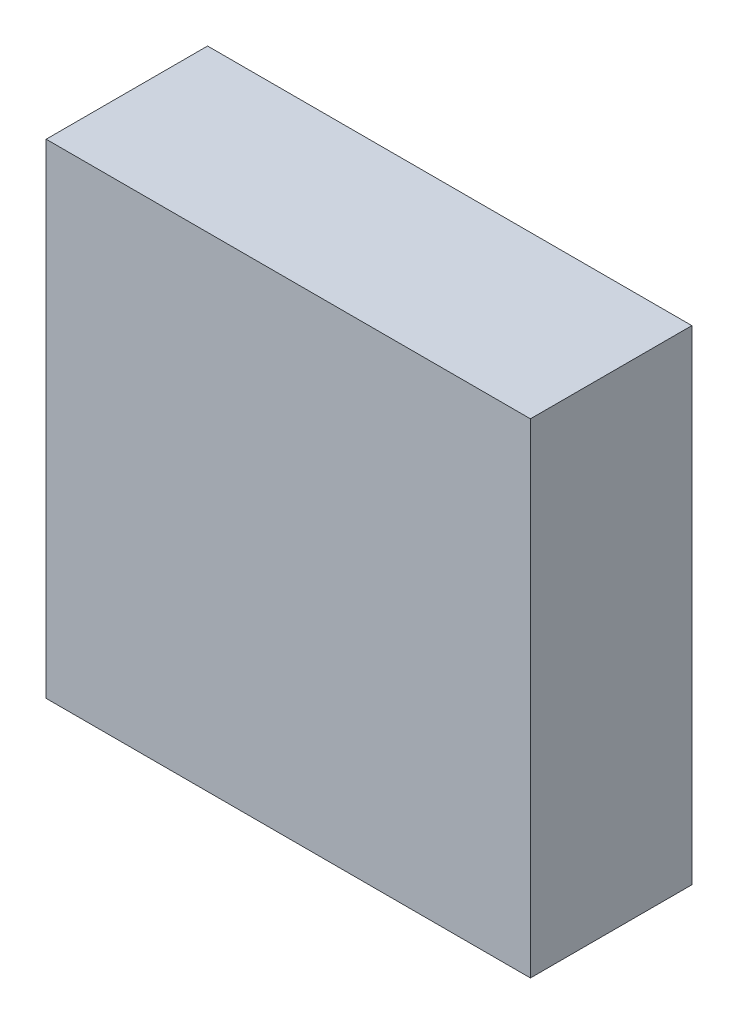
ISO-10303-21;
HEADER;
FILE_DESCRIPTION(('STEP AP214'),'2;1');
FILE_NAME('part.step','',(''),(''),'','','');
FILE_SCHEMA(('AUTOMOTIVE_DESIGN { 1 0 10303 214 1 1 1 1 }'));
ENDSEC;
DATA;
#1=APPLICATION_CONTEXT('core data for automotive mechanical design processes');
#2=APPLICATION_PROTOCOL_DEFINITION('international standard','automotive_design',2000,#1);
#3=PRODUCT_CONTEXT('',#1,'mechanical');
#4=PRODUCT('Part','Part','',(#3));
#5=PRODUCT_RELATED_PRODUCT_CATEGORY('part','',(#4));
#6=PRODUCT_DEFINITION_FORMATION('','',#4);
#7=PRODUCT_DEFINITION_CONTEXT('part definition',#1,'design');
#8=PRODUCT_DEFINITION('design','',#6,#7);
#9=PRODUCT_DEFINITION_SHAPE('','',#8);
#10=(LENGTH_UNIT() NAMED_UNIT(*) SI_UNIT(.MILLI.,.METRE.));
#11=(NAMED_UNIT(*) PLANE_ANGLE_UNIT() SI_UNIT($,.RADIAN.));
#12=(NAMED_UNIT(*) SI_UNIT($,.STERADIAN.) SOLID_ANGLE_UNIT());
#13=UNCERTAINTY_MEASURE_WITH_UNIT(LENGTH_MEASURE(1.E-05),#10,'distance_accuracy_value','');
#14=(GEOMETRIC_REPRESENTATION_CONTEXT(3) GLOBAL_UNCERTAINTY_ASSIGNED_CONTEXT((#13)) GLOBAL_UNIT_ASSIGNED_CONTEXT((#10,
#11,#12)) REPRESENTATION_CONTEXT('',''));
#15=CARTESIAN_POINT('',(0.,0.,0.));
#16=DIRECTION('',(0.,0.,1.));
#17=DIRECTION('',(1.,0.,0.));
#18=AXIS2_PLACEMENT_3D('',#15,#16,#17);
#19=CARTESIAN_POINT('',(1.49998176,-1.49998176,0.));
#20=DIRECTION('',(0.,0.,-1.));
#21=DIRECTION('',(-1.,0.,0.));
#22=AXIS2_PLACEMENT_3D('',#19,#20,#21);
#23=PLANE('',#22);
#24=DIRECTION('',(1.,0.,0.));
#25=VECTOR('',#24,1.);
#26=CARTESIAN_POINT('',(1.49998176,1.49998176,0.));
#27=LINE('',#26,#25);
#28=CARTESIAN_POINT('',(-1.49998176,1.49998176,0.));
#29=VERTEX_POINT('',#28);
#30=CARTESIAN_POINT('',(1.49998176,1.49998176,0.));
#31=VERTEX_POINT('',#30);
#32=EDGE_CURVE('E77',#29,#31,#27,.T.);
#33=ORIENTED_EDGE('',*,*,#32,.T.);
#34=DIRECTION('',(0.,1.,0.));
#35=VECTOR('',#34,1.);
#36=CARTESIAN_POINT('',(1.49998176,-1.49998176,0.));
#37=LINE('',#36,#35);
#38=CARTESIAN_POINT('',(1.49998176,-1.49998176,0.));
#39=VERTEX_POINT('',#38);
#40=EDGE_CURVE('E59',#31,#39,#37,.F.);
#41=ORIENTED_EDGE('',*,*,#40,.T.);
#42=DIRECTION('',(1.,0.,0.));
#43=VECTOR('',#42,1.);
#44=CARTESIAN_POINT('',(-1.49998176,-1.49998176,0.));
#45=LINE('',#44,#43);
#46=CARTESIAN_POINT('',(-1.49998176,-1.49998176,0.));
#47=VERTEX_POINT('',#46);
#48=EDGE_CURVE('E21',#39,#47,#45,.F.);
#49=ORIENTED_EDGE('',*,*,#48,.T.);
#50=DIRECTION('',(0.,1.,0.));
#51=VECTOR('',#50,1.);
#52=CARTESIAN_POINT('',(-1.49998176,1.49998176,0.));
#53=LINE('',#52,#51);
#54=EDGE_CURVE('E56',#47,#29,#53,.T.);
#55=ORIENTED_EDGE('',*,*,#54,.T.);
#56=EDGE_LOOP('',(#33,#41,#49,#55));
#57=FACE_BOUND('',#56,.T.);
#58=ADVANCED_FACE('F18',(#57),#23,.T.);
#59=CARTESIAN_POINT('',(-1.49998176,-1.49998176,0.));
#60=DIRECTION('',(0.,1.,0.));
#61=DIRECTION('',(0.,0.,1.));
#62=AXIS2_PLACEMENT_3D('',#59,#60,#61);
#63=PLANE('',#62);
#64=DIRECTION('',(0.,0.,1.));
#65=VECTOR('',#64,1.);
#66=CARTESIAN_POINT('',(1.49998176,-1.49998176,0.));
#67=LINE('',#66,#65);
#68=CARTESIAN_POINT('',(1.49998176,-1.49998176,1.00000054));
#69=VERTEX_POINT('',#68);
#70=EDGE_CURVE('E79',#39,#69,#67,.T.);
#71=ORIENTED_EDGE('',*,*,#70,.T.);
#72=DIRECTION('',(-1.,0.,0.));
#73=VECTOR('',#72,1.);
#74=CARTESIAN_POINT('',(1.49998176,-1.49998176,1.00000054));
#75=LINE('',#74,#73);
#76=CARTESIAN_POINT('',(-1.49998176,-1.49998176,1.00000054));
#77=VERTEX_POINT('',#76);
#78=EDGE_CURVE('E74',#69,#77,#75,.T.);
#79=ORIENTED_EDGE('',*,*,#78,.T.);
#80=DIRECTION('',(0.,0.,-1.));
#81=VECTOR('',#80,1.);
#82=CARTESIAN_POINT('',(-1.49998176,-1.49998176,0.));
#83=LINE('',#82,#81);
#84=EDGE_CURVE('E64',#77,#47,#83,.T.);
#85=ORIENTED_EDGE('',*,*,#84,.T.);
#86=ORIENTED_EDGE('',*,*,#48,.F.);
#87=EDGE_LOOP('',(#71,#79,#85,#86));
#88=FACE_BOUND('',#87,.T.);
#89=ADVANCED_FACE('F73',(#88),#63,.F.);
#90=CARTESIAN_POINT('',(-1.49998176,1.49998176,0.));
#91=DIRECTION('',(1.,0.,0.));
#92=DIRECTION('',(0.,0.,-1.));
#93=AXIS2_PLACEMENT_3D('',#90,#91,#92);
#94=PLANE('',#93);
#95=ORIENTED_EDGE('',*,*,#84,.F.);
#96=DIRECTION('',(0.,1.,0.));
#97=VECTOR('',#96,1.);
#98=CARTESIAN_POINT('',(-1.49998176,-1.49998176,1.00000054));
#99=LINE('',#98,#97);
#100=CARTESIAN_POINT('',(-1.49998176,1.49998176,1.00000054));
#101=VERTEX_POINT('',#100);
#102=EDGE_CURVE('E84',#77,#101,#99,.T.);
#103=ORIENTED_EDGE('',*,*,#102,.T.);
#104=DIRECTION('',(0.,0.,-1.));
#105=VECTOR('',#104,1.);
#106=CARTESIAN_POINT('',(-1.49998176,1.49998176,0.));
#107=LINE('',#106,#105);
#108=EDGE_CURVE('E70',#101,#29,#107,.T.);
#109=ORIENTED_EDGE('',*,*,#108,.T.);
#110=ORIENTED_EDGE('',*,*,#54,.F.);
#111=EDGE_LOOP('',(#95,#103,#109,#110));
#112=FACE_BOUND('',#111,.T.);
#113=ADVANCED_FACE('F67',(#112),#94,.F.);
#114=CARTESIAN_POINT('',(1.49998176,1.49998176,0.));
#115=DIRECTION('',(0.,-1.,0.));
#116=DIRECTION('',(0.,0.,-1.));
#117=AXIS2_PLACEMENT_3D('',#114,#115,#116);
#118=PLANE('',#117);
#119=ORIENTED_EDGE('',*,*,#108,.F.);
#120=DIRECTION('',(-1.,0.,0.));
#121=VECTOR('',#120,1.);
#122=CARTESIAN_POINT('',(1.49998176,1.49998176,1.00000054));
#123=LINE('',#122,#121);
#124=CARTESIAN_POINT('',(1.49998176,1.49998176,1.00000054));
#125=VERTEX_POINT('',#124);
#126=EDGE_CURVE('E27',#101,#125,#123,.F.);
#127=ORIENTED_EDGE('',*,*,#126,.T.);
#128=DIRECTION('',(0.,0.,1.));
#129=VECTOR('',#128,1.);
#130=CARTESIAN_POINT('',(1.49998176,1.49998176,0.));
#131=LINE('',#130,#129);
#132=EDGE_CURVE('E35',#125,#31,#131,.F.);
#133=ORIENTED_EDGE('',*,*,#132,.T.);
#134=ORIENTED_EDGE('',*,*,#32,.F.);
#135=EDGE_LOOP('',(#119,#127,#133,#134));
#136=FACE_BOUND('',#135,.T.);
#137=ADVANCED_FACE('F89',(#136),#118,.F.);
#138=CARTESIAN_POINT('',(1.49998176,-1.49998176,0.));
#139=DIRECTION('',(-1.,0.,0.));
#140=DIRECTION('',(0.,0.,1.));
#141=AXIS2_PLACEMENT_3D('',#138,#139,#140);
#142=PLANE('',#141);
#143=ORIENTED_EDGE('',*,*,#132,.F.);
#144=DIRECTION('',(0.,1.,0.));
#145=VECTOR('',#144,1.);
#146=CARTESIAN_POINT('',(1.49998176,-1.49998176,1.00000054));
#147=LINE('',#146,#145);
#148=EDGE_CURVE('E11',#125,#69,#147,.F.);
#149=ORIENTED_EDGE('',*,*,#148,.T.);
#150=ORIENTED_EDGE('',*,*,#70,.F.);
#151=ORIENTED_EDGE('',*,*,#40,.F.);
#152=EDGE_LOOP('',(#143,#149,#150,#151));
#153=FACE_BOUND('',#152,.T.);
#154=ADVANCED_FACE('F92',(#153),#142,.F.);
#155=CARTESIAN_POINT('',(1.49998176,-1.49998176,1.00000054));
#156=DIRECTION('',(0.,0.,-1.));
#157=DIRECTION('',(-1.,0.,0.));
#158=AXIS2_PLACEMENT_3D('',#155,#156,#157);
#159=PLANE('',#158);
#160=ORIENTED_EDGE('',*,*,#126,.F.);
#161=ORIENTED_EDGE('',*,*,#102,.F.);
#162=ORIENTED_EDGE('',*,*,#78,.F.);
#163=ORIENTED_EDGE('',*,*,#148,.F.);
#164=EDGE_LOOP('',(#160,#161,#162,#163));
#165=FACE_BOUND('',#164,.T.);
#166=ADVANCED_FACE('F91',(#165),#159,.F.);
#167=CLOSED_SHELL('',(#58,#89,#113,#137,#154,#166));
#168=MANIFOLD_SOLID_BREP('B1',#167);
#169=ADVANCED_BREP_SHAPE_REPRESENTATION('',(#18,#168),#14);
#170=SHAPE_DEFINITION_REPRESENTATION(#9,#169);
ENDSEC;
END-ISO-10303-21;
